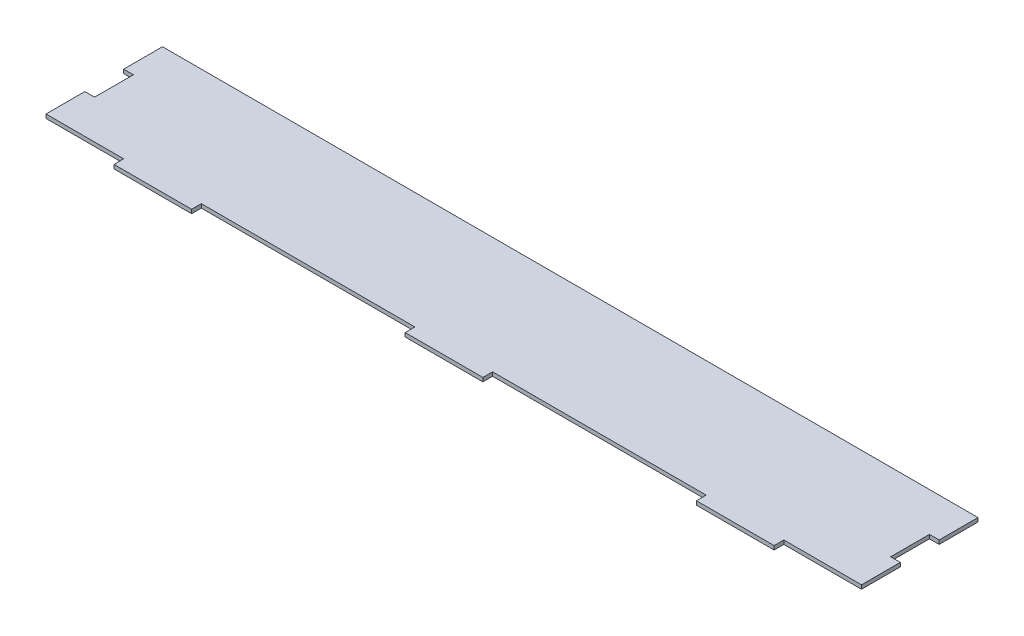
ISO-10303-21;
HEADER;
FILE_DESCRIPTION(('STEP AP214'),'2;1');
FILE_NAME('part.step','',(''),(''),'','','');
FILE_SCHEMA(('AUTOMOTIVE_DESIGN { 1 0 10303 214 1 1 1 1 }'));
ENDSEC;
DATA;
#1=APPLICATION_CONTEXT('core data for automotive mechanical design processes');
#2=APPLICATION_PROTOCOL_DEFINITION('international standard','automotive_design',2000,#1);
#3=PRODUCT_CONTEXT('',#1,'mechanical');
#4=PRODUCT('Part','Part','',(#3));
#5=PRODUCT_RELATED_PRODUCT_CATEGORY('part','',(#4));
#6=PRODUCT_DEFINITION_FORMATION('','',#4);
#7=PRODUCT_DEFINITION_CONTEXT('part definition',#1,'design');
#8=PRODUCT_DEFINITION('design','',#6,#7);
#9=PRODUCT_DEFINITION_SHAPE('','',#8);
#10=(LENGTH_UNIT() NAMED_UNIT(*) SI_UNIT(.MILLI.,.METRE.));
#11=(NAMED_UNIT(*) PLANE_ANGLE_UNIT() SI_UNIT($,.RADIAN.));
#12=(NAMED_UNIT(*) SI_UNIT($,.STERADIAN.) SOLID_ANGLE_UNIT());
#13=UNCERTAINTY_MEASURE_WITH_UNIT(LENGTH_MEASURE(1.E-05),#10,'distance_accuracy_value','');
#14=(GEOMETRIC_REPRESENTATION_CONTEXT(3) GLOBAL_UNCERTAINTY_ASSIGNED_CONTEXT((#13)) GLOBAL_UNIT_ASSIGNED_CONTEXT((#10,
#11,#12)) REPRESENTATION_CONTEXT('',''));
#15=CARTESIAN_POINT('',(0.,0.,0.));
#16=DIRECTION('',(0.,0.,1.));
#17=DIRECTION('',(1.,0.,0.));
#18=AXIS2_PLACEMENT_3D('',#15,#16,#17);
#19=CARTESIAN_POINT('',(292.1,2.54,0.));
#20=DIRECTION('',(1.,0.,0.));
#21=DIRECTION('',(0.,0.,-1.));
#22=AXIS2_PLACEMENT_3D('',#19,#20,#21);
#23=PLANE('',#22);
#24=DIRECTION('',(0.,0.,1.));
#25=VECTOR('',#24,1.);
#26=CARTESIAN_POINT('',(292.1,0.,0.));
#27=LINE('',#26,#25);
#28=CARTESIAN_POINT('',(292.1,0.,76.2000000000001));
#29=VERTEX_POINT('',#28);
#30=CARTESIAN_POINT('',(292.1,0.,82.5500000000001));
#31=VERTEX_POINT('',#30);
#32=EDGE_CURVE('E221',#29,#31,#27,.T.);
#33=ORIENTED_EDGE('',*,*,#32,.F.);
#34=DIRECTION('',(0.,-1.,0.));
#35=VECTOR('',#34,1.);
#36=CARTESIAN_POINT('',(292.1,2.54,76.2000000000001));
#37=LINE('',#36,#35);
#38=CARTESIAN_POINT('',(292.1,2.54,76.2000000000001));
#39=VERTEX_POINT('',#38);
#40=EDGE_CURVE('E11',#39,#29,#37,.T.);
#41=ORIENTED_EDGE('',*,*,#40,.F.);
#42=DIRECTION('',(0.,0.,1.));
#43=VECTOR('',#42,1.);
#44=CARTESIAN_POINT('',(292.1,2.54,0.));
#45=LINE('',#44,#43);
#46=CARTESIAN_POINT('',(292.1,2.54,82.5500000000001));
#47=VERTEX_POINT('',#46);
#48=EDGE_CURVE('E283',#39,#47,#45,.T.);
#49=ORIENTED_EDGE('',*,*,#48,.T.);
#50=DIRECTION('',(0.,-1.,0.));
#51=VECTOR('',#50,1.);
#52=CARTESIAN_POINT('',(292.1,2.54,82.5500000000001));
#53=LINE('',#52,#51);
#54=EDGE_CURVE('E132',#47,#31,#53,.T.);
#55=ORIENTED_EDGE('',*,*,#54,.T.);
#56=EDGE_LOOP('',(#33,#41,#49,#55));
#57=FACE_BOUND('',#56,.T.);
#58=ADVANCED_FACE('F33',(#57),#23,.T.);
#59=CARTESIAN_POINT('',(0.,2.54,76.2000000000001));
#60=DIRECTION('',(0.,0.,-1.));
#61=DIRECTION('',(-1.,0.,0.));
#62=AXIS2_PLACEMENT_3D('',#59,#60,#61);
#63=PLANE('',#62);
#64=DIRECTION('',(1.,0.,0.));
#65=VECTOR('',#64,1.);
#66=CARTESIAN_POINT('',(0.,0.,76.2000000000001));
#67=LINE('',#66,#65);
#68=CARTESIAN_POINT('',(431.8,0.,76.2));
#69=VERTEX_POINT('',#68);
#70=EDGE_CURVE('E224',#29,#69,#67,.T.);
#71=ORIENTED_EDGE('',*,*,#70,.T.);
#72=DIRECTION('',(0.,-1.,0.));
#73=VECTOR('',#72,1.);
#74=CARTESIAN_POINT('',(431.8,2.54,76.2));
#75=LINE('',#74,#73);
#76=CARTESIAN_POINT('',(431.8,2.54,76.2));
#77=VERTEX_POINT('',#76);
#78=EDGE_CURVE('E41',#77,#69,#75,.T.);
#79=ORIENTED_EDGE('',*,*,#78,.F.);
#80=DIRECTION('',(1.,0.,0.));
#81=VECTOR('',#80,1.);
#82=CARTESIAN_POINT('',(0.,2.54,76.2000000000001));
#83=LINE('',#82,#81);
#84=EDGE_CURVE('E352',#39,#77,#83,.T.);
#85=ORIENTED_EDGE('',*,*,#84,.F.);
#86=ORIENTED_EDGE('',*,*,#40,.T.);
#87=EDGE_LOOP('',(#71,#79,#85,#86));
#88=FACE_BOUND('',#87,.T.);
#89=ADVANCED_FACE('F400',(#88),#63,.F.);
#90=CARTESIAN_POINT('',(431.8,2.54,0.));
#91=DIRECTION('',(1.,0.,0.));
#92=DIRECTION('',(0.,0.,-1.));
#93=AXIS2_PLACEMENT_3D('',#90,#91,#92);
#94=PLANE('',#93);
#95=DIRECTION('',(0.,0.,1.));
#96=VECTOR('',#95,1.);
#97=CARTESIAN_POINT('',(431.8,0.,0.));
#98=LINE('',#97,#96);
#99=CARTESIAN_POINT('',(431.8,0.,82.55));
#100=VERTEX_POINT('',#99);
#101=EDGE_CURVE('E226',#69,#100,#98,.T.);
#102=ORIENTED_EDGE('',*,*,#101,.T.);
#103=DIRECTION('',(0.,-1.,0.));
#104=VECTOR('',#103,1.);
#105=CARTESIAN_POINT('',(431.8,2.54,82.55));
#106=LINE('',#105,#104);
#107=CARTESIAN_POINT('',(431.8,2.54,82.55));
#108=VERTEX_POINT('',#107);
#109=EDGE_CURVE('E325',#108,#100,#106,.T.);
#110=ORIENTED_EDGE('',*,*,#109,.F.);
#111=DIRECTION('',(0.,0.,1.));
#112=VECTOR('',#111,1.);
#113=CARTESIAN_POINT('',(431.8,2.54,0.));
#114=LINE('',#113,#112);
#115=EDGE_CURVE('E333',#77,#108,#114,.T.);
#116=ORIENTED_EDGE('',*,*,#115,.F.);
#117=ORIENTED_EDGE('',*,*,#78,.T.);
#118=EDGE_LOOP('',(#102,#110,#116,#117));
#119=FACE_BOUND('',#118,.T.);
#120=ADVANCED_FACE('F331',(#119),#94,.F.);
#121=CARTESIAN_POINT('',(0.,2.54,82.5500000000002));
#122=DIRECTION('',(0.,0.,1.));
#123=DIRECTION('',(1.,0.,0.));
#124=AXIS2_PLACEMENT_3D('',#121,#122,#123);
#125=PLANE('',#124);
#126=DIRECTION('',(-1.,0.,0.));
#127=VECTOR('',#126,1.);
#128=CARTESIAN_POINT('',(0.,0.,82.5500000000002));
#129=LINE('',#128,#127);
#130=CARTESIAN_POINT('',(482.6,0.,82.55));
#131=VERTEX_POINT('',#130);
#132=EDGE_CURVE('E229',#131,#100,#129,.T.);
#133=ORIENTED_EDGE('',*,*,#132,.F.);
#134=DIRECTION('',(0.,-1.,0.));
#135=VECTOR('',#134,1.);
#136=CARTESIAN_POINT('',(482.6,2.54,82.55));
#137=LINE('',#136,#135);
#138=CARTESIAN_POINT('',(482.6,2.54,82.55));
#139=VERTEX_POINT('',#138);
#140=EDGE_CURVE('E323',#139,#131,#137,.T.);
#141=ORIENTED_EDGE('',*,*,#140,.F.);
#142=DIRECTION('',(-1.,0.,0.));
#143=VECTOR('',#142,1.);
#144=CARTESIAN_POINT('',(0.,2.54,82.5500000000002));
#145=LINE('',#144,#143);
#146=EDGE_CURVE('E345',#139,#108,#145,.T.);
#147=ORIENTED_EDGE('',*,*,#146,.T.);
#148=ORIENTED_EDGE('',*,*,#109,.T.);
#149=EDGE_LOOP('',(#133,#141,#147,#148));
#150=FACE_BOUND('',#149,.T.);
#151=ADVANCED_FACE('F342',(#150),#125,.T.);
#152=CARTESIAN_POINT('',(482.6,2.54,0.));
#153=DIRECTION('',(1.,0.,0.));
#154=DIRECTION('',(0.,0.,-1.));
#155=AXIS2_PLACEMENT_3D('',#152,#153,#154);
#156=PLANE('',#155);
#157=DIRECTION('',(0.,0.,1.));
#158=VECTOR('',#157,1.);
#159=CARTESIAN_POINT('',(482.6,0.,0.));
#160=LINE('',#159,#158);
#161=CARTESIAN_POINT('',(482.6,0.,76.2000000000001));
#162=VERTEX_POINT('',#161);
#163=EDGE_CURVE('E232',#162,#131,#160,.T.);
#164=ORIENTED_EDGE('',*,*,#163,.F.);
#165=DIRECTION('',(0.,-1.,0.));
#166=VECTOR('',#165,1.);
#167=CARTESIAN_POINT('',(482.6,2.54,76.2000000000001));
#168=LINE('',#167,#166);
#169=CARTESIAN_POINT('',(482.6,2.54,76.2000000000001));
#170=VERTEX_POINT('',#169);
#171=EDGE_CURVE('E321',#170,#162,#168,.T.);
#172=ORIENTED_EDGE('',*,*,#171,.F.);
#173=DIRECTION('',(0.,0.,1.));
#174=VECTOR('',#173,1.);
#175=CARTESIAN_POINT('',(482.6,2.54,0.));
#176=LINE('',#175,#174);
#177=EDGE_CURVE('E348',#170,#139,#176,.T.);
#178=ORIENTED_EDGE('',*,*,#177,.T.);
#179=ORIENTED_EDGE('',*,*,#140,.T.);
#180=EDGE_LOOP('',(#164,#172,#178,#179));
#181=FACE_BOUND('',#180,.T.);
#182=ADVANCED_FACE('F410',(#181),#156,.T.);
#183=CARTESIAN_POINT('',(1.0408340855861E-13,2.54,76.2000000000007));
#184=DIRECTION('',(0.,0.,-1.));
#185=DIRECTION('',(-1.,0.,0.));
#186=AXIS2_PLACEMENT_3D('',#183,#184,#185);
#187=PLANE('',#186);
#188=DIRECTION('',(1.,0.,0.));
#189=VECTOR('',#188,1.);
#190=CARTESIAN_POINT('',(1.0408340855861E-13,0.,76.2000000000007));
#191=LINE('',#190,#189);
#192=CARTESIAN_POINT('',(533.4,0.,76.2));
#193=VERTEX_POINT('',#192);
#194=EDGE_CURVE('E235',#162,#193,#191,.T.);
#195=ORIENTED_EDGE('',*,*,#194,.T.);
#196=DIRECTION('',(0.,-1.,0.));
#197=VECTOR('',#196,1.);
#198=CARTESIAN_POINT('',(533.4,2.54,76.2));
#199=LINE('',#198,#197);
#200=CARTESIAN_POINT('',(533.4,2.54,76.2));
#201=VERTEX_POINT('',#200);
#202=EDGE_CURVE('E319',#201,#193,#199,.T.);
#203=ORIENTED_EDGE('',*,*,#202,.F.);
#204=DIRECTION('',(1.,0.,0.));
#205=VECTOR('',#204,1.);
#206=CARTESIAN_POINT('',(1.0408340855861E-13,2.54,76.2000000000007));
#207=LINE('',#206,#205);
#208=EDGE_CURVE('E350',#170,#201,#207,.T.);
#209=ORIENTED_EDGE('',*,*,#208,.F.);
#210=ORIENTED_EDGE('',*,*,#171,.T.);
#211=EDGE_LOOP('',(#195,#203,#209,#210));
#212=FACE_BOUND('',#211,.T.);
#213=ADVANCED_FACE('F413',(#212),#187,.F.);
#214=CARTESIAN_POINT('',(533.4,2.54,0.));
#215=DIRECTION('',(1.,0.,0.));
#216=DIRECTION('',(0.,0.,-1.));
#217=AXIS2_PLACEMENT_3D('',#214,#215,#216);
#218=PLANE('',#217);
#219=DIRECTION('',(0.,0.,1.));
#220=VECTOR('',#219,1.);
#221=CARTESIAN_POINT('',(533.4,0.,0.));
#222=LINE('',#221,#220);
#223=CARTESIAN_POINT('',(533.4,0.,50.8));
#224=VERTEX_POINT('',#223);
#225=EDGE_CURVE('E238',#224,#193,#222,.T.);
#226=ORIENTED_EDGE('',*,*,#225,.F.);
#227=DIRECTION('',(0.,-1.,0.));
#228=VECTOR('',#227,1.);
#229=CARTESIAN_POINT('',(533.4,2.54,50.8));
#230=LINE('',#229,#228);
#231=CARTESIAN_POINT('',(533.4,2.54,50.8));
#232=VERTEX_POINT('',#231);
#233=EDGE_CURVE('E317',#232,#224,#230,.T.);
#234=ORIENTED_EDGE('',*,*,#233,.F.);
#235=DIRECTION('',(0.,0.,1.));
#236=VECTOR('',#235,1.);
#237=CARTESIAN_POINT('',(533.4,2.54,0.));
#238=LINE('',#237,#236);
#239=EDGE_CURVE('E357',#232,#201,#238,.T.);
#240=ORIENTED_EDGE('',*,*,#239,.T.);
#241=ORIENTED_EDGE('',*,*,#202,.T.);
#242=EDGE_LOOP('',(#226,#234,#240,#241));
#243=FACE_BOUND('',#242,.T.);
#244=ADVANCED_FACE('F417',(#243),#218,.T.);
#245=CARTESIAN_POINT('',(0.,2.54,50.8));
#246=DIRECTION('',(0.,0.,1.));
#247=DIRECTION('',(1.,0.,0.));
#248=AXIS2_PLACEMENT_3D('',#245,#246,#247);
#249=PLANE('',#248);
#250=DIRECTION('',(-1.,0.,0.));
#251=VECTOR('',#250,1.);
#252=CARTESIAN_POINT('',(0.,0.,50.8));
#253=LINE('',#252,#251);
#254=CARTESIAN_POINT('',(527.05,0.,50.8));
#255=VERTEX_POINT('',#254);
#256=EDGE_CURVE('E241',#224,#255,#253,.T.);
#257=ORIENTED_EDGE('',*,*,#256,.T.);
#258=DIRECTION('',(0.,-1.,0.));
#259=VECTOR('',#258,1.);
#260=CARTESIAN_POINT('',(527.05,2.54,50.8));
#261=LINE('',#260,#259);
#262=CARTESIAN_POINT('',(527.05,2.54,50.8));
#263=VERTEX_POINT('',#262);
#264=EDGE_CURVE('E315',#263,#255,#261,.T.);
#265=ORIENTED_EDGE('',*,*,#264,.F.);
#266=DIRECTION('',(-1.,0.,0.));
#267=VECTOR('',#266,1.);
#268=CARTESIAN_POINT('',(0.,2.54,50.8));
#269=LINE('',#268,#267);
#270=EDGE_CURVE('E360',#232,#263,#269,.T.);
#271=ORIENTED_EDGE('',*,*,#270,.F.);
#272=ORIENTED_EDGE('',*,*,#233,.T.);
#273=EDGE_LOOP('',(#257,#265,#271,#272));
#274=FACE_BOUND('',#273,.T.);
#275=ADVANCED_FACE('F421',(#274),#249,.F.);
#276=CARTESIAN_POINT('',(527.05,2.54,0.));
#277=DIRECTION('',(1.,0.,0.));
#278=DIRECTION('',(0.,0.,-1.));
#279=AXIS2_PLACEMENT_3D('',#276,#277,#278);
#280=PLANE('',#279);
#281=DIRECTION('',(0.,0.,1.));
#282=VECTOR('',#281,1.);
#283=CARTESIAN_POINT('',(527.05,0.,0.));
#284=LINE('',#283,#282);
#285=CARTESIAN_POINT('',(527.05,0.,25.4));
#286=VERTEX_POINT('',#285);
#287=EDGE_CURVE('E244',#286,#255,#284,.T.);
#288=ORIENTED_EDGE('',*,*,#287,.F.);
#289=DIRECTION('',(0.,-1.,0.));
#290=VECTOR('',#289,1.);
#291=CARTESIAN_POINT('',(527.05,2.54,25.4));
#292=LINE('',#291,#290);
#293=CARTESIAN_POINT('',(527.05,2.54,25.4));
#294=VERTEX_POINT('',#293);
#295=EDGE_CURVE('E313',#294,#286,#292,.T.);
#296=ORIENTED_EDGE('',*,*,#295,.F.);
#297=DIRECTION('',(0.,0.,1.));
#298=VECTOR('',#297,1.);
#299=CARTESIAN_POINT('',(527.05,2.54,0.));
#300=LINE('',#299,#298);
#301=EDGE_CURVE('E362',#294,#263,#300,.T.);
#302=ORIENTED_EDGE('',*,*,#301,.T.);
#303=ORIENTED_EDGE('',*,*,#264,.T.);
#304=EDGE_LOOP('',(#288,#296,#302,#303));
#305=FACE_BOUND('',#304,.T.);
#306=ADVANCED_FACE('F425',(#305),#280,.T.);
#307=CARTESIAN_POINT('',(0.,2.54,25.4));
#308=DIRECTION('',(0.,0.,1.));
#309=DIRECTION('',(1.,0.,0.));
#310=AXIS2_PLACEMENT_3D('',#307,#308,#309);
#311=PLANE('',#310);
#312=DIRECTION('',(-1.,0.,0.));
#313=VECTOR('',#312,1.);
#314=CARTESIAN_POINT('',(0.,0.,25.4));
#315=LINE('',#314,#313);
#316=CARTESIAN_POINT('',(533.4,0.,25.4));
#317=VERTEX_POINT('',#316);
#318=EDGE_CURVE('E247',#317,#286,#315,.T.);
#319=ORIENTED_EDGE('',*,*,#318,.F.);
#320=DIRECTION('',(0.,-1.,0.));
#321=VECTOR('',#320,1.);
#322=CARTESIAN_POINT('',(533.4,2.54,25.4));
#323=LINE('',#322,#321);
#324=CARTESIAN_POINT('',(533.4,2.54,25.4));
#325=VERTEX_POINT('',#324);
#326=EDGE_CURVE('E311',#325,#317,#323,.T.);
#327=ORIENTED_EDGE('',*,*,#326,.F.);
#328=DIRECTION('',(-1.,0.,0.));
#329=VECTOR('',#328,1.);
#330=CARTESIAN_POINT('',(0.,2.54,25.4));
#331=LINE('',#330,#329);
#332=EDGE_CURVE('E365',#325,#294,#331,.T.);
#333=ORIENTED_EDGE('',*,*,#332,.T.);
#334=ORIENTED_EDGE('',*,*,#295,.T.);
#335=EDGE_LOOP('',(#319,#327,#333,#334));
#336=FACE_BOUND('',#335,.T.);
#337=ADVANCED_FACE('F429',(#336),#311,.T.);
#338=CARTESIAN_POINT('',(533.4,2.54,0.));
#339=DIRECTION('',(1.,0.,0.));
#340=DIRECTION('',(0.,0.,-1.));
#341=AXIS2_PLACEMENT_3D('',#338,#339,#340);
#342=PLANE('',#341);
#343=DIRECTION('',(0.,0.,1.));
#344=VECTOR('',#343,1.);
#345=CARTESIAN_POINT('',(533.4,0.,0.));
#346=LINE('',#345,#344);
#347=CARTESIAN_POINT('',(533.4,0.,0.));
#348=VERTEX_POINT('',#347);
#349=EDGE_CURVE('E250',#348,#317,#346,.T.);
#350=ORIENTED_EDGE('',*,*,#349,.F.);
#351=DIRECTION('',(0.,-1.,0.));
#352=VECTOR('',#351,1.);
#353=CARTESIAN_POINT('',(533.4,2.54,0.));
#354=LINE('',#353,#352);
#355=CARTESIAN_POINT('',(533.4,2.54,0.));
#356=VERTEX_POINT('',#355);
#357=EDGE_CURVE('E309',#356,#348,#354,.T.);
#358=ORIENTED_EDGE('',*,*,#357,.F.);
#359=DIRECTION('',(0.,0.,1.));
#360=VECTOR('',#359,1.);
#361=CARTESIAN_POINT('',(533.4,2.54,0.));
#362=LINE('',#361,#360);
#363=EDGE_CURVE('E368',#356,#325,#362,.T.);
#364=ORIENTED_EDGE('',*,*,#363,.T.);
#365=ORIENTED_EDGE('',*,*,#326,.T.);
#366=EDGE_LOOP('',(#350,#358,#364,#365));
#367=FACE_BOUND('',#366,.T.);
#368=ADVANCED_FACE('F433',(#367),#342,.T.);
#369=CARTESIAN_POINT('',(0.,2.54,0.));
#370=DIRECTION('',(0.,0.,-1.));
#371=DIRECTION('',(-1.,0.,0.));
#372=AXIS2_PLACEMENT_3D('',#369,#370,#371);
#373=PLANE('',#372);
#374=DIRECTION('',(1.,0.,0.));
#375=VECTOR('',#374,1.);
#376=CARTESIAN_POINT('',(0.,0.,0.));
#377=LINE('',#376,#375);
#378=CARTESIAN_POINT('',(0.,0.,0.));
#379=VERTEX_POINT('',#378);
#380=EDGE_CURVE('E253',#379,#348,#377,.T.);
#381=ORIENTED_EDGE('',*,*,#380,.F.);
#382=DIRECTION('',(0.,-1.,0.));
#383=VECTOR('',#382,1.);
#384=CARTESIAN_POINT('',(0.,2.54,0.));
#385=LINE('',#384,#383);
#386=CARTESIAN_POINT('',(0.,2.54,0.));
#387=VERTEX_POINT('',#386);
#388=EDGE_CURVE('E307',#387,#379,#385,.T.);
#389=ORIENTED_EDGE('',*,*,#388,.F.);
#390=DIRECTION('',(1.,0.,0.));
#391=VECTOR('',#390,1.);
#392=CARTESIAN_POINT('',(0.,2.54,0.));
#393=LINE('',#392,#391);
#394=EDGE_CURVE('E371',#387,#356,#393,.T.);
#395=ORIENTED_EDGE('',*,*,#394,.T.);
#396=ORIENTED_EDGE('',*,*,#357,.T.);
#397=EDGE_LOOP('',(#381,#389,#395,#396));
#398=FACE_BOUND('',#397,.T.);
#399=ADVANCED_FACE('F437',(#398),#373,.T.);
#400=CARTESIAN_POINT('',(0.,2.54,0.));
#401=DIRECTION('',(-1.,0.,0.));
#402=DIRECTION('',(0.,0.,1.));
#403=AXIS2_PLACEMENT_3D('',#400,#401,#402);
#404=PLANE('',#403);
#405=DIRECTION('',(0.,0.,-1.));
#406=VECTOR('',#405,1.);
#407=CARTESIAN_POINT('',(0.,0.,0.));
#408=LINE('',#407,#406);
#409=CARTESIAN_POINT('',(0.,0.,25.4));
#410=VERTEX_POINT('',#409);
#411=EDGE_CURVE('E256',#410,#379,#408,.T.);
#412=ORIENTED_EDGE('',*,*,#411,.F.);
#413=DIRECTION('',(0.,-1.,0.));
#414=VECTOR('',#413,1.);
#415=CARTESIAN_POINT('',(0.,2.54,25.4));
#416=LINE('',#415,#414);
#417=CARTESIAN_POINT('',(0.,2.54,25.4));
#418=VERTEX_POINT('',#417);
#419=EDGE_CURVE('E305',#418,#410,#416,.T.);
#420=ORIENTED_EDGE('',*,*,#419,.F.);
#421=DIRECTION('',(0.,0.,-1.));
#422=VECTOR('',#421,1.);
#423=CARTESIAN_POINT('',(0.,2.54,0.));
#424=LINE('',#423,#422);
#425=EDGE_CURVE('E374',#418,#387,#424,.T.);
#426=ORIENTED_EDGE('',*,*,#425,.T.);
#427=ORIENTED_EDGE('',*,*,#388,.T.);
#428=EDGE_LOOP('',(#412,#420,#426,#427));
#429=FACE_BOUND('',#428,.T.);
#430=ADVANCED_FACE('F441',(#429),#404,.T.);
#431=CARTESIAN_POINT('',(0.,2.54,25.4));
#432=DIRECTION('',(0.,0.,-1.));
#433=DIRECTION('',(-1.,0.,0.));
#434=AXIS2_PLACEMENT_3D('',#431,#432,#433);
#435=PLANE('',#434);
#436=DIRECTION('',(1.,0.,0.));
#437=VECTOR('',#436,1.);
#438=CARTESIAN_POINT('',(0.,0.,25.4));
#439=LINE('',#438,#437);
#440=CARTESIAN_POINT('',(6.34999999999999,0.,25.4));
#441=VERTEX_POINT('',#440);
#442=EDGE_CURVE('E259',#410,#441,#439,.T.);
#443=ORIENTED_EDGE('',*,*,#442,.T.);
#444=DIRECTION('',(0.,-1.,0.));
#445=VECTOR('',#444,1.);
#446=CARTESIAN_POINT('',(6.34999999999999,2.54,25.4));
#447=LINE('',#446,#445);
#448=CARTESIAN_POINT('',(6.34999999999999,2.54,25.4));
#449=VERTEX_POINT('',#448);
#450=EDGE_CURVE('E302',#449,#441,#447,.T.);
#451=ORIENTED_EDGE('',*,*,#450,.F.);
#452=DIRECTION('',(1.,0.,0.));
#453=VECTOR('',#452,1.);
#454=CARTESIAN_POINT('',(0.,2.54,25.4));
#455=LINE('',#454,#453);
#456=EDGE_CURVE('E377',#418,#449,#455,.T.);
#457=ORIENTED_EDGE('',*,*,#456,.F.);
#458=ORIENTED_EDGE('',*,*,#419,.T.);
#459=EDGE_LOOP('',(#443,#451,#457,#458));
#460=FACE_BOUND('',#459,.T.);
#461=ADVANCED_FACE('F445',(#460),#435,.F.);
#462=CARTESIAN_POINT('',(6.34999999999999,2.54,0.));
#463=DIRECTION('',(1.,0.,0.));
#464=DIRECTION('',(0.,0.,-1.));
#465=AXIS2_PLACEMENT_3D('',#462,#463,#464);
#466=PLANE('',#465);
#467=DIRECTION('',(0.,0.,1.));
#468=VECTOR('',#467,1.);
#469=CARTESIAN_POINT('',(6.34999999999999,0.,0.));
#470=LINE('',#469,#468);
#471=CARTESIAN_POINT('',(6.35,0.,50.8));
#472=VERTEX_POINT('',#471);
#473=EDGE_CURVE('E261',#441,#472,#470,.T.);
#474=ORIENTED_EDGE('',*,*,#473,.T.);
#475=DIRECTION('',(0.,-1.,0.));
#476=VECTOR('',#475,1.);
#477=CARTESIAN_POINT('',(6.35,2.54,50.8));
#478=LINE('',#477,#476);
#479=CARTESIAN_POINT('',(6.35,2.54,50.8));
#480=VERTEX_POINT('',#479);
#481=EDGE_CURVE('E300',#480,#472,#478,.T.);
#482=ORIENTED_EDGE('',*,*,#481,.F.);
#483=DIRECTION('',(0.,0.,1.));
#484=VECTOR('',#483,1.);
#485=CARTESIAN_POINT('',(6.34999999999999,2.54,0.));
#486=LINE('',#485,#484);
#487=EDGE_CURVE('E379',#449,#480,#486,.T.);
#488=ORIENTED_EDGE('',*,*,#487,.F.);
#489=ORIENTED_EDGE('',*,*,#450,.T.);
#490=EDGE_LOOP('',(#474,#482,#488,#489));
#491=FACE_BOUND('',#490,.T.);
#492=ADVANCED_FACE('F449',(#491),#466,.F.);
#493=CARTESIAN_POINT('',(0.,2.54,50.8));
#494=DIRECTION('',(0.,0.,-1.));
#495=DIRECTION('',(-1.,0.,0.));
#496=AXIS2_PLACEMENT_3D('',#493,#494,#495);
#497=PLANE('',#496);
#498=DIRECTION('',(1.,0.,0.));
#499=VECTOR('',#498,1.);
#500=CARTESIAN_POINT('',(0.,0.,50.8));
#501=LINE('',#500,#499);
#502=CARTESIAN_POINT('',(0.,0.,50.8));
#503=VERTEX_POINT('',#502);
#504=EDGE_CURVE('E264',#503,#472,#501,.T.);
#505=ORIENTED_EDGE('',*,*,#504,.F.);
#506=DIRECTION('',(0.,-1.,0.));
#507=VECTOR('',#506,1.);
#508=CARTESIAN_POINT('',(0.,2.54,50.8));
#509=LINE('',#508,#507);
#510=CARTESIAN_POINT('',(0.,2.54,50.8));
#511=VERTEX_POINT('',#510);
#512=EDGE_CURVE('E298',#511,#503,#509,.T.);
#513=ORIENTED_EDGE('',*,*,#512,.F.);
#514=DIRECTION('',(1.,0.,0.));
#515=VECTOR('',#514,1.);
#516=CARTESIAN_POINT('',(0.,2.54,50.8));
#517=LINE('',#516,#515);
#518=EDGE_CURVE('E381',#511,#480,#517,.T.);
#519=ORIENTED_EDGE('',*,*,#518,.T.);
#520=ORIENTED_EDGE('',*,*,#481,.T.);
#521=EDGE_LOOP('',(#505,#513,#519,#520));
#522=FACE_BOUND('',#521,.T.);
#523=ADVANCED_FACE('F453',(#522),#497,.T.);
#524=CARTESIAN_POINT('',(0.,2.54,0.));
#525=DIRECTION('',(1.,0.,0.));
#526=DIRECTION('',(0.,0.,-1.));
#527=AXIS2_PLACEMENT_3D('',#524,#525,#526);
#528=PLANE('',#527);
#529=DIRECTION('',(0.,0.,1.));
#530=VECTOR('',#529,1.);
#531=CARTESIAN_POINT('',(0.,0.,0.));
#532=LINE('',#531,#530);
#533=CARTESIAN_POINT('',(0.,0.,76.2000000000001));
#534=VERTEX_POINT('',#533);
#535=EDGE_CURVE('E267',#503,#534,#532,.T.);
#536=ORIENTED_EDGE('',*,*,#535,.T.);
#537=DIRECTION('',(0.,-1.,0.));
#538=VECTOR('',#537,1.);
#539=CARTESIAN_POINT('',(0.,2.54,76.2000000000001));
#540=LINE('',#539,#538);
#541=CARTESIAN_POINT('',(0.,2.54,76.2000000000001));
#542=VERTEX_POINT('',#541);
#543=EDGE_CURVE('E295',#542,#534,#540,.T.);
#544=ORIENTED_EDGE('',*,*,#543,.F.);
#545=DIRECTION('',(0.,0.,1.));
#546=VECTOR('',#545,1.);
#547=CARTESIAN_POINT('',(0.,2.54,0.));
#548=LINE('',#547,#546);
#549=EDGE_CURVE('E384',#511,#542,#548,.T.);
#550=ORIENTED_EDGE('',*,*,#549,.F.);
#551=ORIENTED_EDGE('',*,*,#512,.T.);
#552=EDGE_LOOP('',(#536,#544,#550,#551));
#553=FACE_BOUND('',#552,.T.);
#554=ADVANCED_FACE('F457',(#553),#528,.F.);
#555=CARTESIAN_POINT('',(0.,2.54,76.2000000000001));
#556=DIRECTION('',(0.,0.,-1.));
#557=DIRECTION('',(-1.,0.,0.));
#558=AXIS2_PLACEMENT_3D('',#555,#556,#557);
#559=PLANE('',#558);
#560=DIRECTION('',(1.,0.,0.));
#561=VECTOR('',#560,1.);
#562=CARTESIAN_POINT('',(0.,0.,76.2000000000001));
#563=LINE('',#562,#561);
#564=CARTESIAN_POINT('',(50.8,0.,76.2000000000001));
#565=VERTEX_POINT('',#564);
#566=EDGE_CURVE('E269',#534,#565,#563,.T.);
#567=ORIENTED_EDGE('',*,*,#566,.T.);
#568=DIRECTION('',(0.,-1.,0.));
#569=VECTOR('',#568,1.);
#570=CARTESIAN_POINT('',(50.8,2.54,76.2000000000001));
#571=LINE('',#570,#569);
#572=CARTESIAN_POINT('',(50.8,2.54,76.2000000000001));
#573=VERTEX_POINT('',#572);
#574=EDGE_CURVE('E292',#573,#565,#571,.T.);
#575=ORIENTED_EDGE('',*,*,#574,.F.);
#576=DIRECTION('',(1.,0.,0.));
#577=VECTOR('',#576,1.);
#578=CARTESIAN_POINT('',(0.,2.54,76.2000000000001));
#579=LINE('',#578,#577);
#580=EDGE_CURVE('E386',#542,#573,#579,.T.);
#581=ORIENTED_EDGE('',*,*,#580,.F.);
#582=ORIENTED_EDGE('',*,*,#543,.T.);
#583=EDGE_LOOP('',(#567,#575,#581,#582));
#584=FACE_BOUND('',#583,.T.);
#585=ADVANCED_FACE('F461',(#584),#559,.F.);
#586=CARTESIAN_POINT('',(50.8,2.54,0.));
#587=DIRECTION('',(1.,0.,0.));
#588=DIRECTION('',(0.,0.,-1.));
#589=AXIS2_PLACEMENT_3D('',#586,#587,#588);
#590=PLANE('',#589);
#591=DIRECTION('',(0.,0.,1.));
#592=VECTOR('',#591,1.);
#593=CARTESIAN_POINT('',(50.8,0.,0.));
#594=LINE('',#593,#592);
#595=CARTESIAN_POINT('',(50.8,0.,82.5500000000001));
#596=VERTEX_POINT('',#595);
#597=EDGE_CURVE('E271',#565,#596,#594,.T.);
#598=ORIENTED_EDGE('',*,*,#597,.T.);
#599=DIRECTION('',(0.,-1.,0.));
#600=VECTOR('',#599,1.);
#601=CARTESIAN_POINT('',(50.8,2.54,82.5500000000001));
#602=LINE('',#601,#600);
#603=CARTESIAN_POINT('',(50.8,2.54,82.5500000000001));
#604=VERTEX_POINT('',#603);
#605=EDGE_CURVE('E289',#604,#596,#602,.T.);
#606=ORIENTED_EDGE('',*,*,#605,.F.);
#607=DIRECTION('',(0.,0.,1.));
#608=VECTOR('',#607,1.);
#609=CARTESIAN_POINT('',(50.8,2.54,0.));
#610=LINE('',#609,#608);
#611=EDGE_CURVE('E388',#573,#604,#610,.T.);
#612=ORIENTED_EDGE('',*,*,#611,.F.);
#613=ORIENTED_EDGE('',*,*,#574,.T.);
#614=EDGE_LOOP('',(#598,#606,#612,#613));
#615=FACE_BOUND('',#614,.T.);
#616=ADVANCED_FACE('F465',(#615),#590,.F.);
#617=CARTESIAN_POINT('',(0.,2.54,82.5500000000001));
#618=DIRECTION('',(0.,0.,-1.));
#619=DIRECTION('',(-1.,0.,0.));
#620=AXIS2_PLACEMENT_3D('',#617,#618,#619);
#621=PLANE('',#620);
#622=DIRECTION('',(1.,0.,0.));
#623=VECTOR('',#622,1.);
#624=CARTESIAN_POINT('',(0.,0.,82.5500000000001));
#625=LINE('',#624,#623);
#626=CARTESIAN_POINT('',(101.6,0.,82.5500000000001));
#627=VERTEX_POINT('',#626);
#628=EDGE_CURVE('E273',#596,#627,#625,.T.);
#629=ORIENTED_EDGE('',*,*,#628,.T.);
#630=DIRECTION('',(0.,-1.,0.));
#631=VECTOR('',#630,1.);
#632=CARTESIAN_POINT('',(101.6,2.54,82.5500000000001));
#633=LINE('',#632,#631);
#634=CARTESIAN_POINT('',(101.6,2.54,82.5500000000001));
#635=VERTEX_POINT('',#634);
#636=EDGE_CURVE('E287',#635,#627,#633,.T.);
#637=ORIENTED_EDGE('',*,*,#636,.F.);
#638=DIRECTION('',(1.,0.,0.));
#639=VECTOR('',#638,1.);
#640=CARTESIAN_POINT('',(0.,2.54,82.5500000000001));
#641=LINE('',#640,#639);
#642=EDGE_CURVE('E390',#604,#635,#641,.T.);
#643=ORIENTED_EDGE('',*,*,#642,.F.);
#644=ORIENTED_EDGE('',*,*,#605,.T.);
#645=EDGE_LOOP('',(#629,#637,#643,#644));
#646=FACE_BOUND('',#645,.T.);
#647=ADVANCED_FACE('F469',(#646),#621,.F.);
#648=CARTESIAN_POINT('',(101.6,2.54,0.));
#649=DIRECTION('',(1.,0.,0.));
#650=DIRECTION('',(0.,0.,-1.));
#651=AXIS2_PLACEMENT_3D('',#648,#649,#650);
#652=PLANE('',#651);
#653=DIRECTION('',(0.,0.,1.));
#654=VECTOR('',#653,1.);
#655=CARTESIAN_POINT('',(101.6,0.,0.));
#656=LINE('',#655,#654);
#657=CARTESIAN_POINT('',(101.6,0.,76.2000000000001));
#658=VERTEX_POINT('',#657);
#659=EDGE_CURVE('E276',#658,#627,#656,.T.);
#660=ORIENTED_EDGE('',*,*,#659,.F.);
#661=DIRECTION('',(0.,-1.,0.));
#662=VECTOR('',#661,1.);
#663=CARTESIAN_POINT('',(101.6,2.54,76.2000000000001));
#664=LINE('',#663,#662);
#665=CARTESIAN_POINT('',(101.6,2.54,76.2000000000001));
#666=VERTEX_POINT('',#665);
#667=EDGE_CURVE('E213',#666,#658,#664,.T.);
#668=ORIENTED_EDGE('',*,*,#667,.F.);
#669=DIRECTION('',(0.,0.,1.));
#670=VECTOR('',#669,1.);
#671=CARTESIAN_POINT('',(101.6,2.54,0.));
#672=LINE('',#671,#670);
#673=EDGE_CURVE('E206',#666,#635,#672,.T.);
#674=ORIENTED_EDGE('',*,*,#673,.T.);
#675=ORIENTED_EDGE('',*,*,#636,.T.);
#676=EDGE_LOOP('',(#660,#668,#674,#675));
#677=FACE_BOUND('',#676,.T.);
#678=ADVANCED_FACE('F393',(#677),#652,.T.);
#679=CARTESIAN_POINT('',(0.,2.54,76.2000000000001));
#680=DIRECTION('',(0.,0.,-1.));
#681=DIRECTION('',(-1.,0.,0.));
#682=AXIS2_PLACEMENT_3D('',#679,#680,#681);
#683=PLANE('',#682);
#684=DIRECTION('',(1.,0.,0.));
#685=VECTOR('',#684,1.);
#686=CARTESIAN_POINT('',(0.,0.,76.2000000000001));
#687=LINE('',#686,#685);
#688=CARTESIAN_POINT('',(241.3,0.,76.2000000000001));
#689=VERTEX_POINT('',#688);
#690=EDGE_CURVE('E212',#658,#689,#687,.T.);
#691=ORIENTED_EDGE('',*,*,#690,.T.);
#692=DIRECTION('',(0.,-1.,0.));
#693=VECTOR('',#692,1.);
#694=CARTESIAN_POINT('',(241.3,2.54,76.2000000000001));
#695=LINE('',#694,#693);
#696=CARTESIAN_POINT('',(241.3,2.54,76.2000000000001));
#697=VERTEX_POINT('',#696);
#698=EDGE_CURVE('E209',#697,#689,#695,.T.);
#699=ORIENTED_EDGE('',*,*,#698,.F.);
#700=DIRECTION('',(1.,0.,0.));
#701=VECTOR('',#700,1.);
#702=CARTESIAN_POINT('',(0.,2.54,76.2000000000001));
#703=LINE('',#702,#701);
#704=EDGE_CURVE('E200',#666,#697,#703,.T.);
#705=ORIENTED_EDGE('',*,*,#704,.F.);
#706=ORIENTED_EDGE('',*,*,#667,.T.);
#707=EDGE_LOOP('',(#691,#699,#705,#706));
#708=FACE_BOUND('',#707,.T.);
#709=ADVANCED_FACE('F210',(#708),#683,.F.);
#710=CARTESIAN_POINT('',(241.3,2.54,0.));
#711=DIRECTION('',(1.,0.,0.));
#712=DIRECTION('',(0.,0.,-1.));
#713=AXIS2_PLACEMENT_3D('',#710,#711,#712);
#714=PLANE('',#713);
#715=DIRECTION('',(0.,0.,1.));
#716=VECTOR('',#715,1.);
#717=CARTESIAN_POINT('',(241.3,0.,0.));
#718=LINE('',#717,#716);
#719=CARTESIAN_POINT('',(241.3,0.,82.5500000000001));
#720=VERTEX_POINT('',#719);
#721=EDGE_CURVE('E125',#689,#720,#718,.T.);
#722=ORIENTED_EDGE('',*,*,#721,.T.);
#723=DIRECTION('',(0.,-1.,0.));
#724=VECTOR('',#723,1.);
#725=CARTESIAN_POINT('',(241.3,2.54,82.5500000000001));
#726=LINE('',#725,#724);
#727=CARTESIAN_POINT('',(241.3,2.54,82.5500000000001));
#728=VERTEX_POINT('',#727);
#729=EDGE_CURVE('E214',#728,#720,#726,.T.);
#730=ORIENTED_EDGE('',*,*,#729,.F.);
#731=DIRECTION('',(0.,0.,1.));
#732=VECTOR('',#731,1.);
#733=CARTESIAN_POINT('',(241.3,2.54,0.));
#734=LINE('',#733,#732);
#735=EDGE_CURVE('E204',#697,#728,#734,.T.);
#736=ORIENTED_EDGE('',*,*,#735,.F.);
#737=ORIENTED_EDGE('',*,*,#698,.T.);
#738=EDGE_LOOP('',(#722,#730,#736,#737));
#739=FACE_BOUND('',#738,.T.);
#740=ADVANCED_FACE('F216',(#739),#714,.F.);
#741=CARTESIAN_POINT('',(0.,2.54,82.5500000000001));
#742=DIRECTION('',(0.,0.,-1.));
#743=DIRECTION('',(-1.,0.,0.));
#744=AXIS2_PLACEMENT_3D('',#741,#742,#743);
#745=PLANE('',#744);
#746=DIRECTION('',(1.,0.,0.));
#747=VECTOR('',#746,1.);
#748=CARTESIAN_POINT('',(0.,0.,82.5500000000001));
#749=LINE('',#748,#747);
#750=EDGE_CURVE('E281',#720,#31,#749,.T.);
#751=ORIENTED_EDGE('',*,*,#750,.T.);
#752=ORIENTED_EDGE('',*,*,#54,.F.);
#753=DIRECTION('',(1.,0.,0.));
#754=VECTOR('',#753,1.);
#755=CARTESIAN_POINT('',(0.,2.54,82.5500000000001));
#756=LINE('',#755,#754);
#757=EDGE_CURVE('E49',#728,#47,#756,.T.);
#758=ORIENTED_EDGE('',*,*,#757,.F.);
#759=ORIENTED_EDGE('',*,*,#729,.T.);
#760=EDGE_LOOP('',(#751,#752,#758,#759));
#761=FACE_BOUND('',#760,.T.);
#762=ADVANCED_FACE('F398',(#761),#745,.F.);
#763=CARTESIAN_POINT('',(0.,2.54,0.));
#764=DIRECTION('',(0.,1.,0.));
#765=DIRECTION('',(0.,0.,1.));
#766=AXIS2_PLACEMENT_3D('',#763,#764,#765);
#767=PLANE('',#766);
#768=ORIENTED_EDGE('',*,*,#48,.F.);
#769=ORIENTED_EDGE('',*,*,#84,.T.);
#770=ORIENTED_EDGE('',*,*,#115,.T.);
#771=ORIENTED_EDGE('',*,*,#146,.F.);
#772=ORIENTED_EDGE('',*,*,#177,.F.);
#773=ORIENTED_EDGE('',*,*,#208,.T.);
#774=ORIENTED_EDGE('',*,*,#239,.F.);
#775=ORIENTED_EDGE('',*,*,#270,.T.);
#776=ORIENTED_EDGE('',*,*,#301,.F.);
#777=ORIENTED_EDGE('',*,*,#332,.F.);
#778=ORIENTED_EDGE('',*,*,#363,.F.);
#779=ORIENTED_EDGE('',*,*,#394,.F.);
#780=ORIENTED_EDGE('',*,*,#425,.F.);
#781=ORIENTED_EDGE('',*,*,#456,.T.);
#782=ORIENTED_EDGE('',*,*,#487,.T.);
#783=ORIENTED_EDGE('',*,*,#518,.F.);
#784=ORIENTED_EDGE('',*,*,#549,.T.);
#785=ORIENTED_EDGE('',*,*,#580,.T.);
#786=ORIENTED_EDGE('',*,*,#611,.T.);
#787=ORIENTED_EDGE('',*,*,#642,.T.);
#788=ORIENTED_EDGE('',*,*,#673,.F.);
#789=ORIENTED_EDGE('',*,*,#704,.T.);
#790=ORIENTED_EDGE('',*,*,#735,.T.);
#791=ORIENTED_EDGE('',*,*,#757,.T.);
#792=EDGE_LOOP('',(#768,#769,#770,#771,#772,#773,#774,#775,#776,#777,#778,#779,#780,#781,#782,
#783,#784,#785,#786,#787,#788,#789,#790,#791));
#793=FACE_BOUND('',#792,.T.);
#794=ADVANCED_FACE('F202',(#793),#767,.T.);
#795=CARTESIAN_POINT('',(0.,0.,0.));
#796=DIRECTION('',(0.,1.,0.));
#797=DIRECTION('',(0.,0.,1.));
#798=AXIS2_PLACEMENT_3D('',#795,#796,#797);
#799=PLANE('',#798);
#800=ORIENTED_EDGE('',*,*,#32,.T.);
#801=ORIENTED_EDGE('',*,*,#750,.F.);
#802=ORIENTED_EDGE('',*,*,#721,.F.);
#803=ORIENTED_EDGE('',*,*,#690,.F.);
#804=ORIENTED_EDGE('',*,*,#659,.T.);
#805=ORIENTED_EDGE('',*,*,#628,.F.);
#806=ORIENTED_EDGE('',*,*,#597,.F.);
#807=ORIENTED_EDGE('',*,*,#566,.F.);
#808=ORIENTED_EDGE('',*,*,#535,.F.);
#809=ORIENTED_EDGE('',*,*,#504,.T.);
#810=ORIENTED_EDGE('',*,*,#473,.F.);
#811=ORIENTED_EDGE('',*,*,#442,.F.);
#812=ORIENTED_EDGE('',*,*,#411,.T.);
#813=ORIENTED_EDGE('',*,*,#380,.T.);
#814=ORIENTED_EDGE('',*,*,#349,.T.);
#815=ORIENTED_EDGE('',*,*,#318,.T.);
#816=ORIENTED_EDGE('',*,*,#287,.T.);
#817=ORIENTED_EDGE('',*,*,#256,.F.);
#818=ORIENTED_EDGE('',*,*,#225,.T.);
#819=ORIENTED_EDGE('',*,*,#194,.F.);
#820=ORIENTED_EDGE('',*,*,#163,.T.);
#821=ORIENTED_EDGE('',*,*,#132,.T.);
#822=ORIENTED_EDGE('',*,*,#101,.F.);
#823=ORIENTED_EDGE('',*,*,#70,.F.);
#824=EDGE_LOOP('',(#800,#801,#802,#803,#804,#805,#806,#807,#808,#809,#810,#811,#812,#813,#814,
#815,#816,#817,#818,#819,#820,#821,#822,#823));
#825=FACE_BOUND('',#824,.T.);
#826=ADVANCED_FACE('F337',(#825),#799,.F.);
#827=CLOSED_SHELL('',(#58,#89,#120,#151,#182,#213,#244,#275,#306,#337,#368,#399,#430,#461,#492,
#523,#554,#585,#616,#647,#678,#709,#740,#762,#794,#826));
#828=MANIFOLD_SOLID_BREP('B2',#827);
#829=ADVANCED_BREP_SHAPE_REPRESENTATION('',(#18,#828),#14);
#830=SHAPE_DEFINITION_REPRESENTATION(#9,#829);
ENDSEC;
END-ISO-10303-21;
